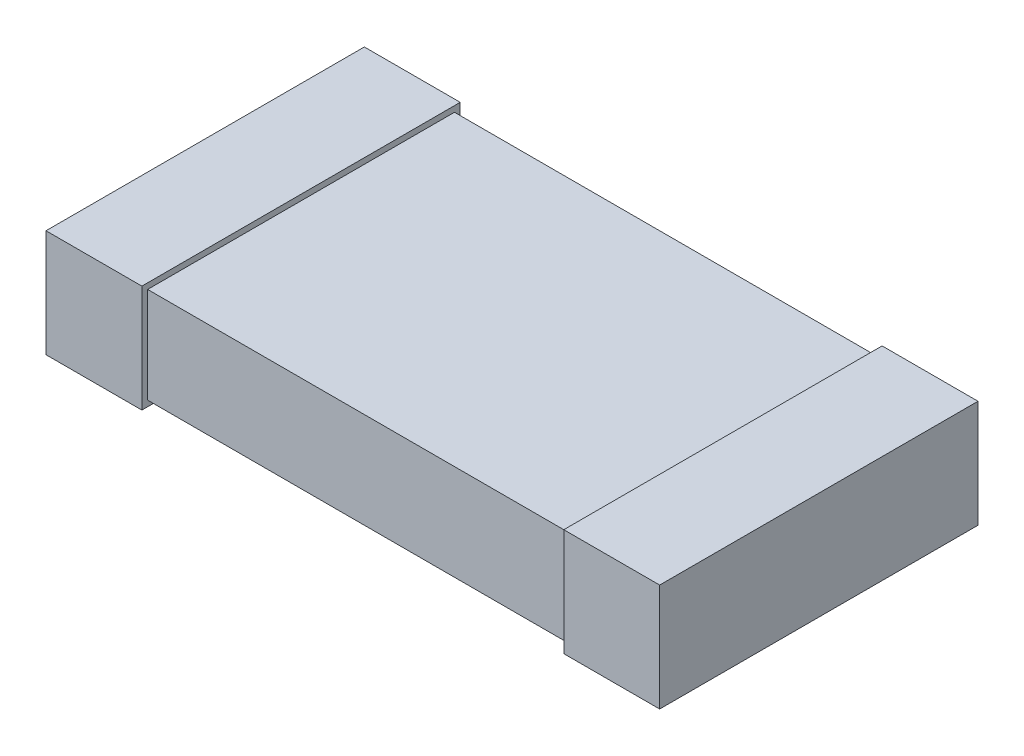
ISO-10303-21;
HEADER;
FILE_DESCRIPTION(('STEP AP214'),'2;1');
FILE_NAME('part.step','',(''),(''),'','','');
FILE_SCHEMA(('AUTOMOTIVE_DESIGN { 1 0 10303 214 1 1 1 1 }'));
ENDSEC;
DATA;
#1=APPLICATION_CONTEXT('core data for automotive mechanical design processes');
#2=APPLICATION_PROTOCOL_DEFINITION('international standard','automotive_design',2000,#1);
#3=PRODUCT_CONTEXT('',#1,'mechanical');
#4=PRODUCT('Part','Part','',(#3));
#5=PRODUCT_RELATED_PRODUCT_CATEGORY('part','',(#4));
#6=PRODUCT_DEFINITION_FORMATION('','',#4);
#7=PRODUCT_DEFINITION_CONTEXT('part definition',#1,'design');
#8=PRODUCT_DEFINITION('design','',#6,#7);
#9=PRODUCT_DEFINITION_SHAPE('','',#8);
#10=(LENGTH_UNIT() NAMED_UNIT(*) SI_UNIT(.MILLI.,.METRE.));
#11=(NAMED_UNIT(*) PLANE_ANGLE_UNIT() SI_UNIT($,.RADIAN.));
#12=(NAMED_UNIT(*) SI_UNIT($,.STERADIAN.) SOLID_ANGLE_UNIT());
#13=UNCERTAINTY_MEASURE_WITH_UNIT(LENGTH_MEASURE(1.E-05),#10,'distance_accuracy_value','');
#14=(GEOMETRIC_REPRESENTATION_CONTEXT(3) GLOBAL_UNCERTAINTY_ASSIGNED_CONTEXT((#13)) GLOBAL_UNIT_ASSIGNED_CONTEXT((#10,
#11,#12)) REPRESENTATION_CONTEXT('',''));
#15=CARTESIAN_POINT('',(0.,0.,0.));
#16=DIRECTION('',(0.,0.,1.));
#17=DIRECTION('',(1.,0.,0.));
#18=AXIS2_PLACEMENT_3D('',#15,#16,#17);
#19=CARTESIAN_POINT('',(-1.6,0.5,0.8));
#20=DIRECTION('',(0.,0.,-1.));
#21=DIRECTION('',(-1.,0.,0.));
#22=AXIS2_PLACEMENT_3D('',#19,#20,#21);
#23=PLANE('',#22);
#24=DIRECTION('',(0.,-1.,0.));
#25=VECTOR('',#24,1.);
#26=CARTESIAN_POINT('',(1.1,0.5,0.8));
#27=LINE('',#26,#25);
#28=CARTESIAN_POINT('',(1.1,0.5,0.8));
#29=VERTEX_POINT('',#28);
#30=CARTESIAN_POINT('',(1.1,0.,0.8));
#31=VERTEX_POINT('',#30);
#32=EDGE_CURVE('E33',#29,#31,#27,.T.);
#33=ORIENTED_EDGE('',*,*,#32,.F.);
#34=DIRECTION('',(1.,0.,0.));
#35=VECTOR('',#34,1.);
#36=CARTESIAN_POINT('',(-1.6,0.5,0.8));
#37=LINE('',#36,#35);
#38=CARTESIAN_POINT('',(-1.1,0.5,0.8));
#39=VERTEX_POINT('',#38);
#40=EDGE_CURVE('E198',#39,#29,#37,.T.);
#41=ORIENTED_EDGE('',*,*,#40,.F.);
#42=DIRECTION('',(0.,1.,0.));
#43=VECTOR('',#42,1.);
#44=CARTESIAN_POINT('',(-1.1,0.5,0.8));
#45=LINE('',#44,#43);
#46=CARTESIAN_POINT('',(-1.1,0.,0.8));
#47=VERTEX_POINT('',#46);
#48=EDGE_CURVE('E192',#47,#39,#45,.T.);
#49=ORIENTED_EDGE('',*,*,#48,.F.);
#50=DIRECTION('',(1.,0.,0.));
#51=VECTOR('',#50,1.);
#52=CARTESIAN_POINT('',(-1.6,0.,0.8));
#53=LINE('',#52,#51);
#54=EDGE_CURVE('E197',#47,#31,#53,.T.);
#55=ORIENTED_EDGE('',*,*,#54,.T.);
#56=EDGE_LOOP('',(#33,#41,#49,#55));
#57=FACE_BOUND('',#56,.T.);
#58=ADVANCED_FACE('F18',(#57),#23,.F.);
#59=CARTESIAN_POINT('',(-1.6,0.5,-0.8));
#60=DIRECTION('',(0.,0.,1.));
#61=DIRECTION('',(1.,0.,0.));
#62=AXIS2_PLACEMENT_3D('',#59,#60,#61);
#63=PLANE('',#62);
#64=DIRECTION('',(0.,1.,0.));
#65=VECTOR('',#64,1.);
#66=CARTESIAN_POINT('',(1.1,0.5,-0.8));
#67=LINE('',#66,#65);
#68=CARTESIAN_POINT('',(1.1,0.,-0.8));
#69=VERTEX_POINT('',#68);
#70=CARTESIAN_POINT('',(1.1,0.5,-0.8));
#71=VERTEX_POINT('',#70);
#72=EDGE_CURVE('E147',#69,#71,#67,.T.);
#73=ORIENTED_EDGE('',*,*,#72,.F.);
#74=DIRECTION('',(-1.,0.,0.));
#75=VECTOR('',#74,1.);
#76=CARTESIAN_POINT('',(-1.6,0.,-0.8));
#77=LINE('',#76,#75);
#78=CARTESIAN_POINT('',(-1.1,0.,-0.8));
#79=VERTEX_POINT('',#78);
#80=EDGE_CURVE('E201',#69,#79,#77,.T.);
#81=ORIENTED_EDGE('',*,*,#80,.T.);
#82=DIRECTION('',(0.,-1.,0.));
#83=VECTOR('',#82,1.);
#84=CARTESIAN_POINT('',(-1.1,0.5,-0.8));
#85=LINE('',#84,#83);
#86=CARTESIAN_POINT('',(-1.1,0.5,-0.8));
#87=VERTEX_POINT('',#86);
#88=EDGE_CURVE('E180',#87,#79,#85,.T.);
#89=ORIENTED_EDGE('',*,*,#88,.F.);
#90=DIRECTION('',(-1.,0.,0.));
#91=VECTOR('',#90,1.);
#92=CARTESIAN_POINT('',(-1.6,0.5,-0.8));
#93=LINE('',#92,#91);
#94=EDGE_CURVE('E200',#71,#87,#93,.T.);
#95=ORIENTED_EDGE('',*,*,#94,.F.);
#96=EDGE_LOOP('',(#73,#81,#89,#95));
#97=FACE_BOUND('',#96,.T.);
#98=ADVANCED_FACE('F218',(#97),#63,.F.);
#99=CARTESIAN_POINT('',(-1.6,0.5,0.8));
#100=DIRECTION('',(0.,1.,0.));
#101=DIRECTION('',(0.,0.,1.));
#102=AXIS2_PLACEMENT_3D('',#99,#100,#101);
#103=PLANE('',#102);
#104=ORIENTED_EDGE('',*,*,#40,.T.);
#105=DIRECTION('',(0.,0.,-1.));
#106=VECTOR('',#105,1.);
#107=CARTESIAN_POINT('',(1.1,0.5,0.8));
#108=LINE('',#107,#106);
#109=EDGE_CURVE('E40',#29,#71,#108,.T.);
#110=ORIENTED_EDGE('',*,*,#109,.T.);
#111=ORIENTED_EDGE('',*,*,#94,.T.);
#112=DIRECTION('',(0.,0.,1.));
#113=VECTOR('',#112,1.);
#114=CARTESIAN_POINT('',(-1.1,0.5,0.8));
#115=LINE('',#114,#113);
#116=EDGE_CURVE('E195',#87,#39,#115,.T.);
#117=ORIENTED_EDGE('',*,*,#116,.T.);
#118=EDGE_LOOP('',(#104,#110,#111,#117));
#119=FACE_BOUND('',#118,.T.);
#120=ADVANCED_FACE('F215',(#119),#103,.T.);
#121=CARTESIAN_POINT('',(-1.6,0.,0.8));
#122=DIRECTION('',(0.,1.,0.));
#123=DIRECTION('',(0.,0.,1.));
#124=AXIS2_PLACEMENT_3D('',#121,#122,#123);
#125=PLANE('',#124);
#126=DIRECTION('',(0.,0.,-1.));
#127=VECTOR('',#126,1.);
#128=CARTESIAN_POINT('',(1.1,0.,0.8));
#129=LINE('',#128,#127);
#130=EDGE_CURVE('E11',#31,#69,#129,.T.);
#131=ORIENTED_EDGE('',*,*,#130,.F.);
#132=ORIENTED_EDGE('',*,*,#54,.F.);
#133=DIRECTION('',(0.,0.,1.));
#134=VECTOR('',#133,1.);
#135=CARTESIAN_POINT('',(-1.1,0.,0.8));
#136=LINE('',#135,#134);
#137=EDGE_CURVE('E26',#79,#47,#136,.T.);
#138=ORIENTED_EDGE('',*,*,#137,.F.);
#139=ORIENTED_EDGE('',*,*,#80,.F.);
#140=EDGE_LOOP('',(#131,#132,#138,#139));
#141=FACE_BOUND('',#140,.T.);
#142=ADVANCED_FACE('F213',(#141),#125,.F.);
#143=CARTESIAN_POINT('',(-1.1,-0.03,1.61073297516494));
#144=DIRECTION('',(0.,1.,0.));
#145=DIRECTION('',(-1.,0.,0.));
#146=AXIS2_PLACEMENT_3D('',#143,#144,#145);
#147=PLANE('',#146);
#148=DIRECTION('',(0.,0.,-1.));
#149=VECTOR('',#148,1.);
#150=CARTESIAN_POINT('',(-1.1,-0.03,1.61073297516494));
#151=LINE('',#150,#149);
#152=CARTESIAN_POINT('',(-1.1,-0.03,0.83));
#153=VERTEX_POINT('',#152);
#154=CARTESIAN_POINT('',(-1.1,-0.03,-0.83));
#155=VERTEX_POINT('',#154);
#156=EDGE_CURVE('E169',#153,#155,#151,.T.);
#157=ORIENTED_EDGE('',*,*,#156,.F.);
#158=DIRECTION('',(-1.,0.,0.));
#159=VECTOR('',#158,1.);
#160=CARTESIAN_POINT('',(-1.1,-0.03,0.83));
#161=LINE('',#160,#159);
#162=CARTESIAN_POINT('',(-1.6,-0.0300000000000001,0.83));
#163=VERTEX_POINT('',#162);
#164=EDGE_CURVE('E174',#153,#163,#161,.T.);
#165=ORIENTED_EDGE('',*,*,#164,.T.);
#166=DIRECTION('',(0.,0.,-1.));
#167=VECTOR('',#166,1.);
#168=CARTESIAN_POINT('',(-1.6,-0.0300000000000001,1.61073297516494));
#169=LINE('',#168,#167);
#170=CARTESIAN_POINT('',(-1.6,-0.0300000000000001,-0.83));
#171=VERTEX_POINT('',#170);
#172=EDGE_CURVE('E182',#163,#171,#169,.T.);
#173=ORIENTED_EDGE('',*,*,#172,.T.);
#174=DIRECTION('',(-1.,0.,0.));
#175=VECTOR('',#174,1.);
#176=CARTESIAN_POINT('',(-1.1,-0.03,-0.83));
#177=LINE('',#176,#175);
#178=EDGE_CURVE('E160',#155,#171,#177,.T.);
#179=ORIENTED_EDGE('',*,*,#178,.F.);
#180=EDGE_LOOP('',(#157,#165,#173,#179));
#181=FACE_BOUND('',#180,.T.);
#182=ADVANCED_FACE('F260',(#181),#147,.F.);
#183=CARTESIAN_POINT('',(-1.1,0.53,1.61073297516494));
#184=DIRECTION('',(0.,-1.,0.));
#185=DIRECTION('',(1.,0.,0.));
#186=AXIS2_PLACEMENT_3D('',#183,#184,#185);
#187=PLANE('',#186);
#188=DIRECTION('',(0.,0.,-1.));
#189=VECTOR('',#188,1.);
#190=CARTESIAN_POINT('',(-1.6,0.53,1.61073297516494));
#191=LINE('',#190,#189);
#192=CARTESIAN_POINT('',(-1.6,0.53,0.83));
#193=VERTEX_POINT('',#192);
#194=CARTESIAN_POINT('',(-1.6,0.53,-0.83));
#195=VERTEX_POINT('',#194);
#196=EDGE_CURVE('E184',#193,#195,#191,.T.);
#197=ORIENTED_EDGE('',*,*,#196,.F.);
#198=DIRECTION('',(1.,0.,0.));
#199=VECTOR('',#198,1.);
#200=CARTESIAN_POINT('',(-1.1,0.53,0.83));
#201=LINE('',#200,#199);
#202=CARTESIAN_POINT('',(-1.1,0.53,0.83));
#203=VERTEX_POINT('',#202);
#204=EDGE_CURVE('E173',#193,#203,#201,.T.);
#205=ORIENTED_EDGE('',*,*,#204,.T.);
#206=DIRECTION('',(0.,0.,-1.));
#207=VECTOR('',#206,1.);
#208=CARTESIAN_POINT('',(-1.1,0.53,1.61073297516494));
#209=LINE('',#208,#207);
#210=CARTESIAN_POINT('',(-1.1,0.53,-0.83));
#211=VERTEX_POINT('',#210);
#212=EDGE_CURVE('E186',#203,#211,#209,.T.);
#213=ORIENTED_EDGE('',*,*,#212,.T.);
#214=DIRECTION('',(1.,0.,0.));
#215=VECTOR('',#214,1.);
#216=CARTESIAN_POINT('',(-1.1,0.53,-0.83));
#217=LINE('',#216,#215);
#218=EDGE_CURVE('E166',#195,#211,#217,.T.);
#219=ORIENTED_EDGE('',*,*,#218,.F.);
#220=EDGE_LOOP('',(#197,#205,#213,#219));
#221=FACE_BOUND('',#220,.T.);
#222=ADVANCED_FACE('F263',(#221),#187,.F.);
#223=CARTESIAN_POINT('',(-1.1,0.53,1.61073297516494));
#224=DIRECTION('',(-1.,0.,0.));
#225=DIRECTION('',(0.,0.,1.));
#226=AXIS2_PLACEMENT_3D('',#223,#224,#225);
#227=PLANE('',#226);
#228=ORIENTED_EDGE('',*,*,#116,.F.);
#229=ORIENTED_EDGE('',*,*,#88,.T.);
#230=ORIENTED_EDGE('',*,*,#137,.T.);
#231=ORIENTED_EDGE('',*,*,#48,.T.);
#232=EDGE_LOOP('',(#228,#229,#230,#231));
#233=FACE_BOUND('',#232,.T.);
#234=ORIENTED_EDGE('',*,*,#212,.F.);
#235=DIRECTION('',(0.,-1.,0.));
#236=VECTOR('',#235,1.);
#237=CARTESIAN_POINT('',(-1.1,0.53,0.83));
#238=LINE('',#237,#236);
#239=EDGE_CURVE('E177',#203,#153,#238,.T.);
#240=ORIENTED_EDGE('',*,*,#239,.T.);
#241=ORIENTED_EDGE('',*,*,#156,.T.);
#242=DIRECTION('',(0.,-1.,0.));
#243=VECTOR('',#242,1.);
#244=CARTESIAN_POINT('',(-1.1,0.53,-0.83));
#245=LINE('',#244,#243);
#246=EDGE_CURVE('E163',#211,#155,#245,.T.);
#247=ORIENTED_EDGE('',*,*,#246,.F.);
#248=EDGE_LOOP('',(#234,#240,#241,#247));
#249=FACE_BOUND('',#248,.T.);
#250=ADVANCED_FACE('F208',(#233,#249),#227,.F.);
#251=CARTESIAN_POINT('',(-1.6,0.5,0.83));
#252=DIRECTION('',(0.,0.,-1.));
#253=DIRECTION('',(-1.,0.,0.));
#254=AXIS2_PLACEMENT_3D('',#251,#252,#253);
#255=PLANE('',#254);
#256=ORIENTED_EDGE('',*,*,#204,.F.);
#257=DIRECTION('',(0.,1.,0.));
#258=VECTOR('',#257,1.);
#259=CARTESIAN_POINT('',(-1.6,0.53,0.83));
#260=LINE('',#259,#258);
#261=EDGE_CURVE('E170',#163,#193,#260,.T.);
#262=ORIENTED_EDGE('',*,*,#261,.F.);
#263=ORIENTED_EDGE('',*,*,#164,.F.);
#264=ORIENTED_EDGE('',*,*,#239,.F.);
#265=EDGE_LOOP('',(#256,#262,#263,#264));
#266=FACE_BOUND('',#265,.T.);
#267=ADVANCED_FACE('F255',(#266),#255,.F.);
#268=CARTESIAN_POINT('',(-1.6,0.5,-0.83));
#269=DIRECTION('',(0.,0.,1.));
#270=DIRECTION('',(1.,0.,0.));
#271=AXIS2_PLACEMENT_3D('',#268,#269,#270);
#272=PLANE('',#271);
#273=ORIENTED_EDGE('',*,*,#246,.T.);
#274=ORIENTED_EDGE('',*,*,#178,.T.);
#275=DIRECTION('',(0.,1.,0.));
#276=VECTOR('',#275,1.);
#277=CARTESIAN_POINT('',(-1.6,0.53,-0.83));
#278=LINE('',#277,#276);
#279=EDGE_CURVE('E157',#171,#195,#278,.T.);
#280=ORIENTED_EDGE('',*,*,#279,.T.);
#281=ORIENTED_EDGE('',*,*,#218,.T.);
#282=EDGE_LOOP('',(#273,#274,#280,#281));
#283=FACE_BOUND('',#282,.T.);
#284=ADVANCED_FACE('F252',(#283),#272,.F.);
#285=CARTESIAN_POINT('',(-1.6,0.5,-0.8));
#286=DIRECTION('',(1.,0.,0.));
#287=DIRECTION('',(0.,0.,-1.));
#288=AXIS2_PLACEMENT_3D('',#285,#286,#287);
#289=PLANE('',#288);
#290=ORIENTED_EDGE('',*,*,#172,.F.);
#291=ORIENTED_EDGE('',*,*,#261,.T.);
#292=ORIENTED_EDGE('',*,*,#196,.T.);
#293=ORIENTED_EDGE('',*,*,#279,.F.);
#294=EDGE_LOOP('',(#290,#291,#292,#293));
#295=FACE_BOUND('',#294,.T.);
#296=ADVANCED_FACE('F20',(#295),#289,.F.);
#297=CARTESIAN_POINT('',(1.1,-0.0299999999999997,1.61073297516494));
#298=DIRECTION('',(0.,1.,0.));
#299=DIRECTION('',(-1.,0.,0.));
#300=AXIS2_PLACEMENT_3D('',#297,#298,#299);
#301=PLANE('',#300);
#302=DIRECTION('',(0.,0.,-1.));
#303=VECTOR('',#302,1.);
#304=CARTESIAN_POINT('',(1.6,-0.0299999999999997,1.61073297516494));
#305=LINE('',#304,#303);
#306=CARTESIAN_POINT('',(1.6,-0.0299999999999997,0.83));
#307=VERTEX_POINT('',#306);
#308=CARTESIAN_POINT('',(1.6,-0.0299999999999997,-0.83));
#309=VERTEX_POINT('',#308);
#310=EDGE_CURVE('E120',#307,#309,#305,.T.);
#311=ORIENTED_EDGE('',*,*,#310,.F.);
#312=DIRECTION('',(-1.,0.,0.));
#313=VECTOR('',#312,1.);
#314=CARTESIAN_POINT('',(1.1,-0.0299999999999997,0.83));
#315=LINE('',#314,#313);
#316=CARTESIAN_POINT('',(1.1,-0.0299999999999997,0.83));
#317=VERTEX_POINT('',#316);
#318=EDGE_CURVE('E115',#307,#317,#315,.T.);
#319=ORIENTED_EDGE('',*,*,#318,.T.);
#320=DIRECTION('',(0.,0.,-1.));
#321=VECTOR('',#320,1.);
#322=CARTESIAN_POINT('',(1.1,-0.0299999999999997,1.61073297516494));
#323=LINE('',#322,#321);
#324=CARTESIAN_POINT('',(1.1,-0.0299999999999997,-0.83));
#325=VERTEX_POINT('',#324);
#326=EDGE_CURVE('E110',#317,#325,#323,.T.);
#327=ORIENTED_EDGE('',*,*,#326,.T.);
#328=DIRECTION('',(-1.,0.,0.));
#329=VECTOR('',#328,1.);
#330=CARTESIAN_POINT('',(1.1,-0.0299999999999997,-0.83));
#331=LINE('',#330,#329);
#332=EDGE_CURVE('E114',#309,#325,#331,.T.);
#333=ORIENTED_EDGE('',*,*,#332,.F.);
#334=EDGE_LOOP('',(#311,#319,#327,#333));
#335=FACE_BOUND('',#334,.T.);
#336=ADVANCED_FACE('F113',(#335),#301,.F.);
#337=CARTESIAN_POINT('',(1.1,0.53,1.61073297516494));
#338=DIRECTION('',(1.,0.,0.));
#339=DIRECTION('',(0.,0.,-1.));
#340=AXIS2_PLACEMENT_3D('',#337,#338,#339);
#341=PLANE('',#340);
#342=ORIENTED_EDGE('',*,*,#109,.F.);
#343=ORIENTED_EDGE('',*,*,#32,.T.);
#344=ORIENTED_EDGE('',*,*,#130,.T.);
#345=ORIENTED_EDGE('',*,*,#72,.T.);
#346=EDGE_LOOP('',(#342,#343,#344,#345));
#347=FACE_BOUND('',#346,.T.);
#348=ORIENTED_EDGE('',*,*,#326,.F.);
#349=DIRECTION('',(0.,1.,0.));
#350=VECTOR('',#349,1.);
#351=CARTESIAN_POINT('',(1.1,0.53,0.83));
#352=LINE('',#351,#350);
#353=CARTESIAN_POINT('',(1.1,0.53,0.83));
#354=VERTEX_POINT('',#353);
#355=EDGE_CURVE('E142',#317,#354,#352,.T.);
#356=ORIENTED_EDGE('',*,*,#355,.T.);
#357=DIRECTION('',(0.,0.,-1.));
#358=VECTOR('',#357,1.);
#359=CARTESIAN_POINT('',(1.1,0.53,1.61073297516494));
#360=LINE('',#359,#358);
#361=CARTESIAN_POINT('',(1.1,0.53,-0.83));
#362=VERTEX_POINT('',#361);
#363=EDGE_CURVE('E119',#354,#362,#360,.T.);
#364=ORIENTED_EDGE('',*,*,#363,.T.);
#365=DIRECTION('',(0.,1.,0.));
#366=VECTOR('',#365,1.);
#367=CARTESIAN_POINT('',(1.1,0.53,-0.83));
#368=LINE('',#367,#366);
#369=EDGE_CURVE('E127',#325,#362,#368,.T.);
#370=ORIENTED_EDGE('',*,*,#369,.F.);
#371=EDGE_LOOP('',(#348,#356,#364,#370));
#372=FACE_BOUND('',#371,.T.);
#373=ADVANCED_FACE('F132',(#347,#372),#341,.F.);
#374=CARTESIAN_POINT('',(1.1,0.53,1.61073297516494));
#375=DIRECTION('',(0.,-1.,0.));
#376=DIRECTION('',(1.,0.,0.));
#377=AXIS2_PLACEMENT_3D('',#374,#375,#376);
#378=PLANE('',#377);
#379=ORIENTED_EDGE('',*,*,#363,.F.);
#380=DIRECTION('',(1.,0.,0.));
#381=VECTOR('',#380,1.);
#382=CARTESIAN_POINT('',(1.1,0.53,0.83));
#383=LINE('',#382,#381);
#384=CARTESIAN_POINT('',(1.6,0.53,0.83));
#385=VERTEX_POINT('',#384);
#386=EDGE_CURVE('E145',#354,#385,#383,.T.);
#387=ORIENTED_EDGE('',*,*,#386,.T.);
#388=DIRECTION('',(0.,0.,-1.));
#389=VECTOR('',#388,1.);
#390=CARTESIAN_POINT('',(1.6,0.53,1.61073297516494));
#391=LINE('',#390,#389);
#392=CARTESIAN_POINT('',(1.6,0.53,-0.83));
#393=VERTEX_POINT('',#392);
#394=EDGE_CURVE('E134',#385,#393,#391,.T.);
#395=ORIENTED_EDGE('',*,*,#394,.T.);
#396=DIRECTION('',(1.,0.,0.));
#397=VECTOR('',#396,1.);
#398=CARTESIAN_POINT('',(1.1,0.53,-0.83));
#399=LINE('',#398,#397);
#400=EDGE_CURVE('E135',#362,#393,#399,.T.);
#401=ORIENTED_EDGE('',*,*,#400,.F.);
#402=EDGE_LOOP('',(#379,#387,#395,#401));
#403=FACE_BOUND('',#402,.T.);
#404=ADVANCED_FACE('F239',(#403),#378,.F.);
#405=CARTESIAN_POINT('',(-1.6,0.5,0.83));
#406=DIRECTION('',(0.,0.,-1.));
#407=DIRECTION('',(-1.,0.,0.));
#408=AXIS2_PLACEMENT_3D('',#405,#406,#407);
#409=PLANE('',#408);
#410=ORIENTED_EDGE('',*,*,#355,.F.);
#411=ORIENTED_EDGE('',*,*,#318,.F.);
#412=DIRECTION('',(0.,-1.,0.));
#413=VECTOR('',#412,1.);
#414=CARTESIAN_POINT('',(1.6,0.53,0.83));
#415=LINE('',#414,#413);
#416=EDGE_CURVE('E143',#385,#307,#415,.T.);
#417=ORIENTED_EDGE('',*,*,#416,.F.);
#418=ORIENTED_EDGE('',*,*,#386,.F.);
#419=EDGE_LOOP('',(#410,#411,#417,#418));
#420=FACE_BOUND('',#419,.T.);
#421=ADVANCED_FACE('F235',(#420),#409,.F.);
#422=CARTESIAN_POINT('',(-1.6,0.5,-0.83));
#423=DIRECTION('',(0.,0.,1.));
#424=DIRECTION('',(1.,0.,0.));
#425=AXIS2_PLACEMENT_3D('',#422,#423,#424);
#426=PLANE('',#425);
#427=ORIENTED_EDGE('',*,*,#400,.T.);
#428=DIRECTION('',(0.,-1.,0.));
#429=VECTOR('',#428,1.);
#430=CARTESIAN_POINT('',(1.6,0.53,-0.83));
#431=LINE('',#430,#429);
#432=EDGE_CURVE('E130',#393,#309,#431,.T.);
#433=ORIENTED_EDGE('',*,*,#432,.T.);
#434=ORIENTED_EDGE('',*,*,#332,.T.);
#435=ORIENTED_EDGE('',*,*,#369,.T.);
#436=EDGE_LOOP('',(#427,#433,#434,#435));
#437=FACE_BOUND('',#436,.T.);
#438=ADVANCED_FACE('F126',(#437),#426,.F.);
#439=CARTESIAN_POINT('',(1.6,0.5,-0.8));
#440=DIRECTION('',(-1.,0.,0.));
#441=DIRECTION('',(0.,0.,1.));
#442=AXIS2_PLACEMENT_3D('',#439,#440,#441);
#443=PLANE('',#442);
#444=ORIENTED_EDGE('',*,*,#394,.F.);
#445=ORIENTED_EDGE('',*,*,#416,.T.);
#446=ORIENTED_EDGE('',*,*,#310,.T.);
#447=ORIENTED_EDGE('',*,*,#432,.F.);
#448=EDGE_LOOP('',(#444,#445,#446,#447));
#449=FACE_BOUND('',#448,.T.);
#450=ADVANCED_FACE('F229',(#449),#443,.F.);
#451=CLOSED_SHELL('',(#58,#98,#120,#142,#182,#222,#250,#267,#284,#296,#336,#373,#404,#421,#438,#450));
#452=MANIFOLD_SOLID_BREP('B1',#451);
#453=ADVANCED_BREP_SHAPE_REPRESENTATION('',(#18,#452),#14);
#454=SHAPE_DEFINITION_REPRESENTATION(#9,#453);
ENDSEC;
END-ISO-10303-21;
